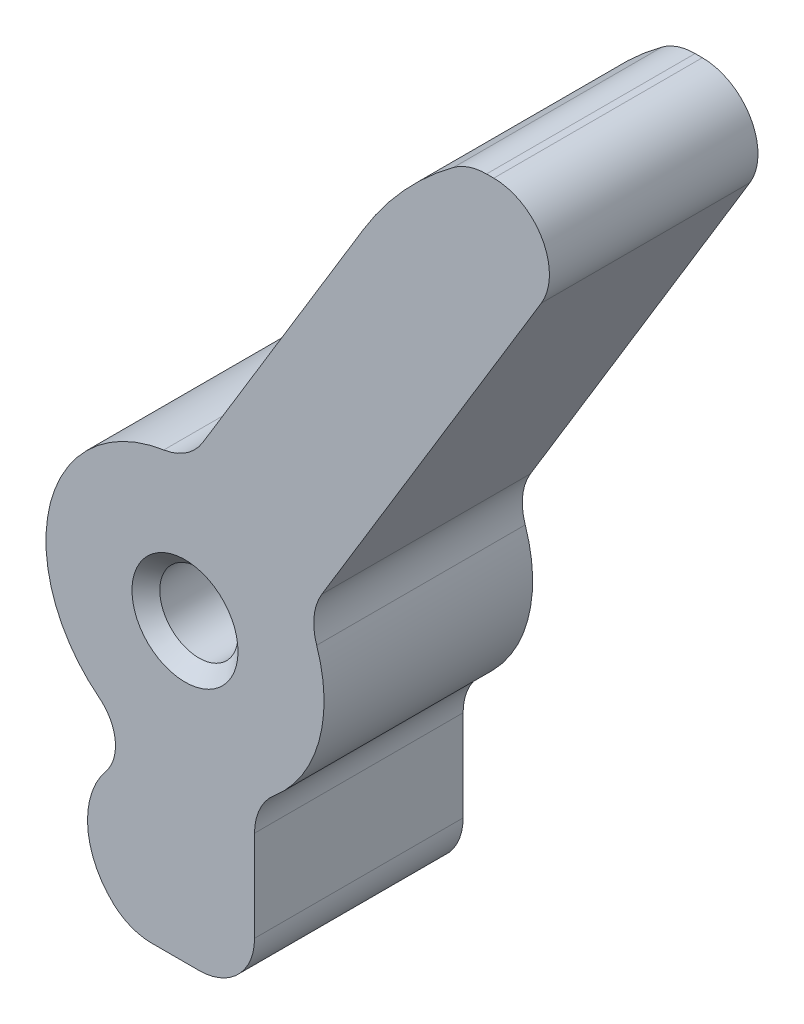
ISO-10303-21;
HEADER;
FILE_DESCRIPTION(('STEP AP214'),'2;1');
FILE_NAME('part.step','',(''),(''),'','','');
FILE_SCHEMA(('AUTOMOTIVE_DESIGN { 1 0 10303 214 1 1 1 1 }'));
ENDSEC;
DATA;
#1=APPLICATION_CONTEXT('core data for automotive mechanical design processes');
#2=APPLICATION_PROTOCOL_DEFINITION('international standard','automotive_design',2000,#1);
#3=PRODUCT_CONTEXT('',#1,'mechanical');
#4=PRODUCT('Part','Part','',(#3));
#5=PRODUCT_RELATED_PRODUCT_CATEGORY('part','',(#4));
#6=PRODUCT_DEFINITION_FORMATION('','',#4);
#7=PRODUCT_DEFINITION_CONTEXT('part definition',#1,'design');
#8=PRODUCT_DEFINITION('design','',#6,#7);
#9=PRODUCT_DEFINITION_SHAPE('','',#8);
#10=(LENGTH_UNIT() NAMED_UNIT(*) SI_UNIT(.MILLI.,.METRE.));
#11=(NAMED_UNIT(*) PLANE_ANGLE_UNIT() SI_UNIT($,.RADIAN.));
#12=(NAMED_UNIT(*) SI_UNIT($,.STERADIAN.) SOLID_ANGLE_UNIT());
#13=UNCERTAINTY_MEASURE_WITH_UNIT(LENGTH_MEASURE(1.E-05),#10,'distance_accuracy_value','');
#14=(GEOMETRIC_REPRESENTATION_CONTEXT(3) GLOBAL_UNCERTAINTY_ASSIGNED_CONTEXT((#13)) GLOBAL_UNIT_ASSIGNED_CONTEXT((#10,
#11,#12)) REPRESENTATION_CONTEXT('',''));
#15=CARTESIAN_POINT('',(0.,0.,0.));
#16=DIRECTION('',(0.,0.,1.));
#17=DIRECTION('',(1.,0.,0.));
#18=AXIS2_PLACEMENT_3D('',#15,#16,#17);
#19=CARTESIAN_POINT('',(10.3283778610675,-19.2479842895087,5.715));
#20=CARTESIAN_POINT('',(10.3283778610675,-19.2479842895087,5.39750000000007));
#21=CARTESIAN_POINT('',(10.3283778610674,-19.2479842895088,5.0799999999999));
#22=CARTESIAN_POINT('',(10.3283778610674,-19.2479842895088,1.58750000000095));
#23=CARTESIAN_POINT('',(10.3283778610674,-19.2479842895088,-1.58750000000067));
#24=CARTESIAN_POINT('',(10.3283778610674,-19.2479842895088,-5.07999999999993));
#25=CARTESIAN_POINT('',(10.3283778610675,-19.2479842895087,-5.39750000000005));
#26=CARTESIAN_POINT('',(10.3283778610675,-19.2479842895087,-5.715));
#27=CARTESIAN_POINT('',(11.0604904353129,-18.35229711104,5.715));
#28=CARTESIAN_POINT('',(11.0604904353129,-18.35229711104,5.39750000000007));
#29=CARTESIAN_POINT('',(11.0604904353128,-18.35229711104,5.0799999999999));
#30=CARTESIAN_POINT('',(11.0604904353128,-18.35229711104,1.58750000000095));
#31=CARTESIAN_POINT('',(11.0604904353128,-18.35229711104,-1.58750000000067));
#32=CARTESIAN_POINT('',(11.0604904353128,-18.35229711104,-5.07999999999993));
#33=CARTESIAN_POINT('',(11.0604904353129,-18.35229711104,-5.39750000000005));
#34=CARTESIAN_POINT('',(11.0604904353129,-18.35229711104,-5.715));
#35=CARTESIAN_POINT('',(10.9332681868804,-17.2024889346275,5.715));
#36=CARTESIAN_POINT('',(10.9332681868804,-17.2024889346275,5.39750000000017));
#37=CARTESIAN_POINT('',(10.9332681868803,-17.2024889346275,5.07999999999976));
#38=CARTESIAN_POINT('',(10.9332681868803,-17.2024889346275,1.58750000000233));
#39=CARTESIAN_POINT('',(10.9332681868803,-17.2024889346275,-1.58750000000067));
#40=CARTESIAN_POINT('',(10.9332681868803,-17.2024889346275,-5.07999999999993));
#41=CARTESIAN_POINT('',(10.9332681868804,-17.2024889346275,-5.39750000000004));
#42=CARTESIAN_POINT('',(10.9332681868804,-17.2024889346275,-5.715));
#43=CARTESIAN_POINT('',(10.0230527558896,-16.4885195989922,5.715));
#44=CARTESIAN_POINT('',(10.0230527558896,-16.4885195989922,5.39750000000017));
#45=CARTESIAN_POINT('',(10.0230527558895,-16.4885195989921,5.07999999999976));
#46=CARTESIAN_POINT('',(10.0230527558895,-16.4885195989921,1.58750000000233));
#47=CARTESIAN_POINT('',(10.0230527558895,-16.4885195989921,-1.58750000000067));
#48=CARTESIAN_POINT('',(10.0230527558895,-16.4885195989921,-5.07999999999993));
#49=CARTESIAN_POINT('',(10.0230527558896,-16.4885195989922,-5.39750000000004));
#50=CARTESIAN_POINT('',(10.0230527558896,-16.4885195989922,-5.715));
#51=(BOUNDED_SURFACE() B_SPLINE_SURFACE(3,3,((#19,#20,#21,#22,#23,#24,#25,#26),(#27,#28,#29,#30,
#31,#32,#33,#34),(#35,#36,#37,#38,#39,#40,#41,#42),(#43,#44,#45,#46,#47,#48,#49,#50)),
.UNSPECIFIED.,.F.,.F.,.F.) B_SPLINE_SURFACE_WITH_KNOTS((4,4),(4,2,2,4),(0.,1.),(-0.1,0.,1.,1.1),
.UNSPECIFIED.) GEOMETRIC_REPRESENTATION_ITEM() RATIONAL_B_SPLINE_SURFACE(((1.,1.,1.,1.,1.,1.,1.,
1.),(0.799978276702998,0.799978276702998,0.799978276703005,0.799978276703005,0.799978276703005,
0.799978276703005,0.799978276702998,0.799978276702998),(0.799978276702998,0.799978276702998,
0.799978276703005,0.799978276703005,0.799978276703005,0.799978276703005,0.799978276702998,
0.799978276702998),(1.,1.,1.,1.,1.,1.,1.,1.))) REPRESENTATION_ITEM('') SURFACE());
#52=CARTESIAN_POINT('',(10.0230527558896,-16.4885195989922,5.715));
#53=CARTESIAN_POINT('',(10.0230527558896,-16.4885195989922,5.39750000000017));
#54=CARTESIAN_POINT('',(10.0230527558895,-16.4885195989921,5.07999999999976));
#55=CARTESIAN_POINT('',(10.0230527558895,-16.4885195989921,1.58750000000233));
#56=CARTESIAN_POINT('',(10.0230527558895,-16.4885195989921,-1.58750000000067));
#57=CARTESIAN_POINT('',(10.0230527558895,-16.4885195989921,-5.07999999999993));
#58=CARTESIAN_POINT('',(10.0230527558896,-16.4885195989922,-5.39750000000004));
#59=CARTESIAN_POINT('',(10.0230527558896,-16.4885195989922,-5.715));
#60=(BOUNDED_CURVE() B_SPLINE_CURVE(3,(#52,#53,#54,#55,#56,#57,#58,#59),.UNSPECIFIED.,.F.,
.F.) B_SPLINE_CURVE_WITH_KNOTS((4,2,2,4),(-0.1,0.,1.,1.1),
.UNSPECIFIED.) CURVE() GEOMETRIC_REPRESENTATION_ITEM() RATIONAL_B_SPLINE_CURVE((1.,1.,1.,1.,1.,
1.,1.,1.)) REPRESENTATION_ITEM(''));
#61=CARTESIAN_POINT('',(10.0230527558895,-16.4885195989921,-4.7625));
#62=VERTEX_POINT('',#61);
#63=CARTESIAN_POINT('',(10.0230527558895,-16.4885195989921,4.7625));
#64=VERTEX_POINT('',#63);
#65=EDGE_CURVE('E265',#62,#64,#60,.F.);
#66=CARTESIAN_POINT('',(10.0230527558895,-16.4885195989921,-4.7625));
#67=CARTESIAN_POINT('',(10.9332681868803,-17.2024889346275,-4.7625));
#68=CARTESIAN_POINT('',(11.0604904353128,-18.35229711104,-4.7625));
#69=CARTESIAN_POINT('',(10.3283778610674,-19.2479842895088,-4.7625));
#70=(BOUNDED_CURVE() B_SPLINE_CURVE(3,(#66,#67,#68,#69),.UNSPECIFIED.,.F.,
.F.) B_SPLINE_CURVE_WITH_KNOTS((4,4),(0.,1.),
.UNSPECIFIED.) CURVE() GEOMETRIC_REPRESENTATION_ITEM() RATIONAL_B_SPLINE_CURVE((1.,
0.799978276703005,0.799978276703005,1.)) REPRESENTATION_ITEM(''));
#71=CARTESIAN_POINT('',(10.3283778610674,-19.2479842895088,-4.7625));
#72=VERTEX_POINT('',#71);
#73=EDGE_CURVE('E50',#62,#72,#70,.T.);
#74=CARTESIAN_POINT('',(10.3283778610675,-19.2479842895087,-5.715));
#75=CARTESIAN_POINT('',(10.3283778610675,-19.2479842895087,-5.39750000000005));
#76=CARTESIAN_POINT('',(10.3283778610674,-19.2479842895088,-5.07999999999993));
#77=CARTESIAN_POINT('',(10.3283778610674,-19.2479842895088,-1.58750000000067));
#78=CARTESIAN_POINT('',(10.3283778610674,-19.2479842895088,1.58750000000095));
#79=CARTESIAN_POINT('',(10.3283778610674,-19.2479842895088,5.0799999999999));
#80=CARTESIAN_POINT('',(10.3283778610675,-19.2479842895087,5.39750000000007));
#81=CARTESIAN_POINT('',(10.3283778610675,-19.2479842895087,5.715));
#82=(BOUNDED_CURVE() B_SPLINE_CURVE(3,(#74,#75,#76,#77,#78,#79,#80,#81),.UNSPECIFIED.,.F.,
.F.) B_SPLINE_CURVE_WITH_KNOTS((4,2,2,4),(-0.1,0.,1.,1.1),
.UNSPECIFIED.) CURVE() GEOMETRIC_REPRESENTATION_ITEM() RATIONAL_B_SPLINE_CURVE((1.,1.,1.,1.,1.,
1.,1.,1.)) REPRESENTATION_ITEM(''));
#83=CARTESIAN_POINT('',(10.3283778610674,-19.2479842895088,4.7625));
#84=VERTEX_POINT('',#83);
#85=EDGE_CURVE('E209',#84,#72,#82,.F.);
#86=CARTESIAN_POINT('',(10.3283778610674,-19.2479842895088,4.7625));
#87=CARTESIAN_POINT('',(11.0604904353128,-18.35229711104,4.7625));
#88=CARTESIAN_POINT('',(10.9332681868803,-17.2024889346275,4.7625));
#89=CARTESIAN_POINT('',(10.0230527558895,-16.4885195989921,4.7625));
#90=(BOUNDED_CURVE() B_SPLINE_CURVE(3,(#86,#87,#88,#89),.UNSPECIFIED.,.F.,
.F.) B_SPLINE_CURVE_WITH_KNOTS((4,4),(0.,1.),
.UNSPECIFIED.) CURVE() GEOMETRIC_REPRESENTATION_ITEM() RATIONAL_B_SPLINE_CURVE((1.,
0.799978276703005,0.799978276703005,1.)) REPRESENTATION_ITEM(''));
#91=EDGE_CURVE('E11',#84,#64,#90,.T.);
#92=ORIENTED_EDGE('',*,*,#65,.F.);
#93=ORIENTED_EDGE('',*,*,#73,.T.);
#94=ORIENTED_EDGE('',*,*,#85,.F.);
#95=ORIENTED_EDGE('',*,*,#91,.T.);
#96=EDGE_LOOP('',(#92,#93,#94,#95));
#97=FACE_BOUND('',#96,.T.);
#98=ADVANCED_FACE('F36',(#97),#51,.T.);
#99=CARTESIAN_POINT('',(35.5869251003677,-0.117322862183878,4.7625));
#100=DIRECTION('',(0.,0.,-1.));
#101=DIRECTION('',(-1.,0.,0.));
#102=AXIS2_PLACEMENT_3D('',#99,#100,#101);
#103=CYLINDRICAL_SURFACE('',#102,15.7811653443104);
#104=CARTESIAN_POINT('',(35.5869251003677,-0.117322862183878,4.7625));
#105=DIRECTION('',(0.,0.,1.));
#106=DIRECTION('',(1.,0.,0.));
#107=AXIS2_PLACEMENT_3D('',#104,#105,#106);
#108=CIRCLE('',#107,15.7811653443104);
#109=CARTESIAN_POINT('',(22.09433781333,8.06774084716687,4.7625));
#110=VERTEX_POINT('',#109);
#111=CARTESIAN_POINT('',(26.2012987581433,12.5694891009772,4.7625));
#112=VERTEX_POINT('',#111);
#113=EDGE_CURVE('E164',#110,#112,#108,.F.);
#114=ORIENTED_EDGE('',*,*,#113,.T.);
#115=DIRECTION('',(0.,0.,-1.));
#116=VECTOR('',#115,1.);
#117=CARTESIAN_POINT('',(26.2012987581433,12.5694891009772,4.7625));
#118=LINE('',#117,#116);
#119=CARTESIAN_POINT('',(26.2012987581433,12.5694891009772,-4.7625));
#120=VERTEX_POINT('',#119);
#121=EDGE_CURVE('E434',#112,#120,#118,.T.);
#122=ORIENTED_EDGE('',*,*,#121,.T.);
#123=CARTESIAN_POINT('',(35.5869251003677,-0.117322862183878,-4.7625));
#124=DIRECTION('',(0.,0.,1.));
#125=DIRECTION('',(1.,0.,0.));
#126=AXIS2_PLACEMENT_3D('',#123,#124,#125);
#127=CIRCLE('',#126,15.7811653443104);
#128=CARTESIAN_POINT('',(22.09433781333,8.06774084716687,-4.7625));
#129=VERTEX_POINT('',#128);
#130=EDGE_CURVE('E167',#129,#120,#127,.F.);
#131=ORIENTED_EDGE('',*,*,#130,.F.);
#132=DIRECTION('',(0.,0.,-1.));
#133=VECTOR('',#132,1.);
#134=CARTESIAN_POINT('',(22.09433781333,8.06774084716687,4.7625));
#135=LINE('',#134,#133);
#136=EDGE_CURVE('E159',#110,#129,#135,.T.);
#137=ORIENTED_EDGE('',*,*,#136,.F.);
#138=EDGE_LOOP('',(#114,#122,#131,#137));
#139=FACE_BOUND('',#138,.T.);
#140=ADVANCED_FACE('F161',(#139),#103,.T.);
#141=CARTESIAN_POINT('',(12.5731789623014,-7.6273192565797,4.7625));
#142=DIRECTION('',(0.854980414478849,-0.518660284634919,0.));
#143=DIRECTION('',(0.518660284634919,0.854980414478849,0.));
#144=AXIS2_PLACEMENT_3D('',#141,#142,#143);
#145=PLANE('',#144);
#146=DIRECTION('',(-0.518660284634919,-0.854980414478849,0.));
#147=VECTOR('',#146,1.);
#148=CARTESIAN_POINT('',(12.5731789623014,-7.6273192565797,-4.7625));
#149=LINE('',#148,#147);
#150=CARTESIAN_POINT('',(14.7594605671866,-4.02336497650998,-4.7625));
#151=VERTEX_POINT('',#150);
#152=EDGE_CURVE('E281',#129,#151,#149,.T.);
#153=ORIENTED_EDGE('',*,*,#152,.T.);
#154=DIRECTION('',(0.,0.,1.));
#155=VECTOR('',#154,1.);
#156=CARTESIAN_POINT('',(14.7594605671866,-4.02336497650998,4.7625));
#157=LINE('',#156,#155);
#158=CARTESIAN_POINT('',(14.7594605671866,-4.02336497650998,4.7625));
#159=VERTEX_POINT('',#158);
#160=EDGE_CURVE('E171',#151,#159,#157,.T.);
#161=ORIENTED_EDGE('',*,*,#160,.T.);
#162=DIRECTION('',(-0.518660284634919,-0.854980414478849,0.));
#163=VECTOR('',#162,1.);
#164=CARTESIAN_POINT('',(12.5731789623014,-7.6273192565797,4.7625));
#165=LINE('',#164,#163);
#166=EDGE_CURVE('E176',#110,#159,#165,.T.);
#167=ORIENTED_EDGE('',*,*,#166,.F.);
#168=ORIENTED_EDGE('',*,*,#136,.T.);
#169=EDGE_LOOP('',(#153,#161,#167,#168));
#170=FACE_BOUND('',#169,.T.);
#171=ADVANCED_FACE('F177',(#170),#145,.F.);
#172=CARTESIAN_POINT('',(13.2019720435092,-21.5967891901671,4.7625));
#173=DIRECTION('',(0.,0.,-1.));
#174=DIRECTION('',(-1.,0.,0.));
#175=AXIS2_PLACEMENT_3D('',#172,#173,#174);
#176=CYLINDRICAL_SURFACE('',#175,3.71139165094716);
#177=CARTESIAN_POINT('',(13.2019720435092,-21.5967891901671,4.7625));
#178=DIRECTION('',(0.,0.,1.));
#179=DIRECTION('',(1.,0.,0.));
#180=AXIS2_PLACEMENT_3D('',#177,#178,#179);
#181=CIRCLE('',#180,3.71139165094716);
#182=CARTESIAN_POINT('',(10.6910364554056,-24.3298516591046,4.7625));
#183=VERTEX_POINT('',#182);
#184=EDGE_CURVE('E179',#84,#183,#181,.T.);
#185=ORIENTED_EDGE('',*,*,#184,.F.);
#186=ORIENTED_EDGE('',*,*,#85,.T.);
#187=CARTESIAN_POINT('',(13.2019720435092,-21.5967891901671,-4.7625));
#188=DIRECTION('',(0.,0.,1.));
#189=DIRECTION('',(1.,0.,0.));
#190=AXIS2_PLACEMENT_3D('',#187,#188,#189);
#191=CIRCLE('',#190,3.71139165094716);
#192=CARTESIAN_POINT('',(10.6910364554056,-24.3298516591046,-4.7625));
#193=VERTEX_POINT('',#192);
#194=EDGE_CURVE('E203',#72,#193,#191,.T.);
#195=ORIENTED_EDGE('',*,*,#194,.T.);
#196=DIRECTION('',(0.,0.,-1.));
#197=VECTOR('',#196,1.);
#198=CARTESIAN_POINT('',(10.6910364554056,-24.3298516591046,4.7625));
#199=LINE('',#198,#197);
#200=EDGE_CURVE('E379',#193,#183,#199,.F.);
#201=ORIENTED_EDGE('',*,*,#200,.T.);
#202=EDGE_LOOP('',(#185,#186,#195,#201));
#203=FACE_BOUND('',#202,.T.);
#204=ADVANCED_FACE('F216',(#203),#176,.T.);
#205=CARTESIAN_POINT('',(0.,-24.9994,4.7625));
#206=DIRECTION('',(0.,-1.,0.));
#207=DIRECTION('',(0.,0.,-1.));
#208=AXIS2_PLACEMENT_3D('',#205,#206,#207);
#209=PLANE('',#208);
#210=DIRECTION('',(-1.,0.,0.));
#211=VECTOR('',#210,1.);
#212=CARTESIAN_POINT('',(0.,-24.9994,4.7625));
#213=LINE('',#212,#211);
#214=CARTESIAN_POINT('',(14.5771458224967,-24.9994,4.7625));
#215=VERTEX_POINT('',#214);
#216=CARTESIAN_POINT('',(12.409469052557,-24.9994,4.7625));
#217=VERTEX_POINT('',#216);
#218=EDGE_CURVE('E198',#215,#217,#213,.T.);
#219=ORIENTED_EDGE('',*,*,#218,.T.);
#220=DIRECTION('',(0.,0.,1.));
#221=VECTOR('',#220,1.);
#222=CARTESIAN_POINT('',(12.409469052557,-24.9994,-4.7625));
#223=LINE('',#222,#221);
#224=CARTESIAN_POINT('',(12.409469052557,-24.9994,-4.7625));
#225=VERTEX_POINT('',#224);
#226=EDGE_CURVE('E392',#217,#225,#223,.F.);
#227=ORIENTED_EDGE('',*,*,#226,.T.);
#228=DIRECTION('',(-1.,0.,0.));
#229=VECTOR('',#228,1.);
#230=CARTESIAN_POINT('',(0.,-24.9994,-4.7625));
#231=LINE('',#230,#229);
#232=CARTESIAN_POINT('',(14.5771458224967,-24.9994,-4.7625));
#233=VERTEX_POINT('',#232);
#234=EDGE_CURVE('E467',#233,#225,#231,.T.);
#235=ORIENTED_EDGE('',*,*,#234,.F.);
#236=DIRECTION('',(0.,0.,-1.));
#237=VECTOR('',#236,1.);
#238=CARTESIAN_POINT('',(14.5771458224967,-24.9994,4.7625));
#239=LINE('',#238,#237);
#240=EDGE_CURVE('E395',#233,#215,#239,.F.);
#241=ORIENTED_EDGE('',*,*,#240,.T.);
#242=EDGE_LOOP('',(#219,#227,#235,#241));
#243=FACE_BOUND('',#242,.T.);
#244=ADVANCED_FACE('F226',(#243),#209,.T.);
#245=CARTESIAN_POINT('',(17.1171458224967,0.,4.7625));
#246=DIRECTION('',(1.,0.,0.));
#247=DIRECTION('',(0.,0.,-1.));
#248=AXIS2_PLACEMENT_3D('',#245,#246,#247);
#249=PLANE('',#248);
#250=DIRECTION('',(0.,-1.,0.));
#251=VECTOR('',#250,1.);
#252=CARTESIAN_POINT('',(17.1171458224967,0.,4.7625));
#253=LINE('',#252,#251);
#254=CARTESIAN_POINT('',(17.1171458224967,-18.301816362175,4.7625));
#255=VERTEX_POINT('',#254);
#256=CARTESIAN_POINT('',(17.1171458224967,-22.4594,4.7625));
#257=VERTEX_POINT('',#256);
#258=EDGE_CURVE('E396',#255,#257,#253,.T.);
#259=ORIENTED_EDGE('',*,*,#258,.T.);
#260=DIRECTION('',(0.,0.,-1.));
#261=VECTOR('',#260,1.);
#262=CARTESIAN_POINT('',(17.1171458224967,-22.4594,4.7625));
#263=LINE('',#262,#261);
#264=CARTESIAN_POINT('',(17.1171458224967,-22.4594,-4.7625));
#265=VERTEX_POINT('',#264);
#266=EDGE_CURVE('E416',#257,#265,#263,.T.);
#267=ORIENTED_EDGE('',*,*,#266,.T.);
#268=DIRECTION('',(0.,-1.,0.));
#269=VECTOR('',#268,1.);
#270=CARTESIAN_POINT('',(17.1171458224967,0.,-4.7625));
#271=LINE('',#270,#269);
#272=CARTESIAN_POINT('',(17.1171458224967,-18.301816362175,-4.7625));
#273=VERTEX_POINT('',#272);
#274=EDGE_CURVE('E469',#273,#265,#271,.T.);
#275=ORIENTED_EDGE('',*,*,#274,.F.);
#276=DIRECTION('',(0.,0.,-1.));
#277=VECTOR('',#276,1.);
#278=CARTESIAN_POINT('',(17.1171458224967,-18.301816362175,4.7625));
#279=LINE('',#278,#277);
#280=EDGE_CURVE('E386',#273,#255,#279,.F.);
#281=ORIENTED_EDGE('',*,*,#280,.T.);
#282=EDGE_LOOP('',(#259,#267,#275,#281));
#283=FACE_BOUND('',#282,.T.);
#284=ADVANCED_FACE('F476',(#283),#249,.T.);
#285=CARTESIAN_POINT('',(18.0023045942421,-10.9208120640114,4.7625));
#286=DIRECTION('',(0.854980414478849,-0.518660284634919,0.));
#287=DIRECTION('',(0.518660284634919,0.854980414478849,0.));
#288=AXIS2_PLACEMENT_3D('',#285,#286,#287);
#289=PLANE('',#288);
#290=DIRECTION('',(-0.518660284634919,-0.854980414478849,0.));
#291=VECTOR('',#290,1.);
#292=CARTESIAN_POINT('',(18.0023045942421,-10.9208120640114,4.7625));
#293=LINE('',#292,#291);
#294=CARTESIAN_POINT('',(30.214422190365,9.21013235820704,4.7625));
#295=VERTEX_POINT('',#294);
#296=CARTESIAN_POINT('',(20.1885861991273,-7.31685778394172,4.7625));
#297=VERTEX_POINT('',#296);
#298=EDGE_CURVE('E457',#295,#297,#293,.T.);
#299=ORIENTED_EDGE('',*,*,#298,.T.);
#300=DIRECTION('',(0.,0.,-1.));
#301=VECTOR('',#300,1.);
#302=CARTESIAN_POINT('',(20.1885861991273,-7.31685778394172,-4.7625));
#303=LINE('',#302,#301);
#304=CARTESIAN_POINT('',(20.1885861991273,-7.31685778394172,-4.7625));
#305=VERTEX_POINT('',#304);
#306=EDGE_CURVE('E427',#297,#305,#303,.T.);
#307=ORIENTED_EDGE('',*,*,#306,.T.);
#308=DIRECTION('',(-0.518660284634919,-0.854980414478849,0.));
#309=VECTOR('',#308,1.);
#310=CARTESIAN_POINT('',(18.0023045942421,-10.9208120640114,-4.7625));
#311=LINE('',#310,#309);
#312=CARTESIAN_POINT('',(30.214422190365,9.21013235820704,-4.7625));
#313=VERTEX_POINT('',#312);
#314=EDGE_CURVE('E189',#313,#305,#311,.T.);
#315=ORIENTED_EDGE('',*,*,#314,.F.);
#316=DIRECTION('',(0.,0.,-1.));
#317=VECTOR('',#316,1.);
#318=CARTESIAN_POINT('',(30.214422190365,9.21013235820704,4.7625));
#319=LINE('',#318,#317);
#320=EDGE_CURVE('E425',#313,#295,#319,.F.);
#321=ORIENTED_EDGE('',*,*,#320,.T.);
#322=EDGE_LOOP('',(#299,#307,#315,#321));
#323=FACE_BOUND('',#322,.T.);
#324=ADVANCED_FACE('F328',(#323),#289,.T.);
#325=CARTESIAN_POINT('',(0.,13.0675294811797,4.7625));
#326=DIRECTION('',(0.,-1.,0.));
#327=DIRECTION('',(0.,0.,-1.));
#328=AXIS2_PLACEMENT_3D('',#325,#326,#327);
#329=PLANE('',#328);
#330=DIRECTION('',(-1.,0.,0.));
#331=VECTOR('',#330,1.);
#332=CARTESIAN_POINT('',(0.,13.0675294811797,4.7625));
#333=LINE('',#332,#331);
#334=CARTESIAN_POINT('',(28.0427719375887,13.0675294811797,4.7625));
#335=VERTEX_POINT('',#334);
#336=CARTESIAN_POINT('',(27.7119280677744,13.0675294811797,4.7625));
#337=VERTEX_POINT('',#336);
#338=EDGE_CURVE('E172',#335,#337,#333,.T.);
#339=ORIENTED_EDGE('',*,*,#338,.F.);
#340=DIRECTION('',(0.,0.,-1.));
#341=VECTOR('',#340,1.);
#342=CARTESIAN_POINT('',(28.0427719375887,13.0675294811797,-4.7625));
#343=LINE('',#342,#341);
#344=CARTESIAN_POINT('',(28.0427719375887,13.0675294811797,-4.7625));
#345=VERTEX_POINT('',#344);
#346=EDGE_CURVE('E431',#335,#345,#343,.T.);
#347=ORIENTED_EDGE('',*,*,#346,.T.);
#348=DIRECTION('',(-1.,0.,0.));
#349=VECTOR('',#348,1.);
#350=CARTESIAN_POINT('',(0.,13.0675294811797,-4.7625));
#351=LINE('',#350,#349);
#352=CARTESIAN_POINT('',(27.7119280677744,13.0675294811797,-4.7625));
#353=VERTEX_POINT('',#352);
#354=EDGE_CURVE('E186',#345,#353,#351,.T.);
#355=ORIENTED_EDGE('',*,*,#354,.T.);
#356=DIRECTION('',(0.,0.,1.));
#357=VECTOR('',#356,1.);
#358=CARTESIAN_POINT('',(27.7119280677744,13.0675294811797,4.7625));
#359=LINE('',#358,#357);
#360=EDGE_CURVE('E429',#353,#337,#359,.T.);
#361=ORIENTED_EDGE('',*,*,#360,.T.);
#362=EDGE_LOOP('',(#339,#347,#355,#361));
#363=FACE_BOUND('',#362,.T.);
#364=ADVANCED_FACE('F321',(#363),#329,.F.);
#365=CARTESIAN_POINT('',(0.,0.,4.7625));
#366=DIRECTION('',(0.,0.,1.));
#367=DIRECTION('',(1.,0.,0.));
#368=AXIS2_PLACEMENT_3D('',#365,#366,#367);
#369=PLANE('',#368);
#370=ORIENTED_EDGE('',*,*,#91,.F.);
#371=ORIENTED_EDGE('',*,*,#184,.T.);
#372=CARTESIAN_POINT('',(12.409469052557,-22.4594,4.7625));
#373=DIRECTION('',(0.,0.,1.));
#374=DIRECTION('',(1.,0.,0.));
#375=AXIS2_PLACEMENT_3D('',#372,#373,#374);
#376=CIRCLE('',#375,2.54);
#377=EDGE_CURVE('E382',#183,#217,#376,.T.);
#378=ORIENTED_EDGE('',*,*,#377,.T.);
#379=ORIENTED_EDGE('',*,*,#218,.F.);
#380=CARTESIAN_POINT('',(14.5771458224967,-22.4594,4.7625));
#381=DIRECTION('',(0.,0.,1.));
#382=DIRECTION('',(1.,0.,0.));
#383=AXIS2_PLACEMENT_3D('',#380,#381,#382);
#384=CIRCLE('',#383,2.54);
#385=EDGE_CURVE('E387',#215,#257,#384,.T.);
#386=ORIENTED_EDGE('',*,*,#385,.T.);
#387=ORIENTED_EDGE('',*,*,#258,.F.);
#388=CARTESIAN_POINT('',(19.6571458224967,-18.301816362175,4.7625));
#389=DIRECTION('',(0.,0.,1.));
#390=DIRECTION('',(1.,0.,0.));
#391=AXIS2_PLACEMENT_3D('',#388,#389,#390);
#392=CIRCLE('',#391,2.54);
#393=CARTESIAN_POINT('',(18.0242886796395,-16.3562116872679,4.7625));
#394=VERTEX_POINT('',#393);
#395=EDGE_CURVE('E442',#255,#394,#392,.F.);
#396=ORIENTED_EDGE('',*,*,#395,.T.);
#397=CARTESIAN_POINT('',(13.9421458224967,-11.4922000000001,4.7625));
#398=DIRECTION('',(0.,0.,1.));
#399=DIRECTION('',(1.,0.,0.));
#400=AXIS2_PLACEMENT_3D('',#397,#398,#399);
#401=CIRCLE('',#400,6.35);
#402=CARTESIAN_POINT('',(19.9550677006444,-9.45081064779604,4.7625));
#403=VERTEX_POINT('',#402);
#404=EDGE_CURVE('E192',#394,#403,#401,.T.);
#405=ORIENTED_EDGE('',*,*,#404,.T.);
#406=CARTESIAN_POINT('',(22.3602364519035,-8.63425490691441,4.7625));
#407=DIRECTION('',(0.,0.,1.));
#408=DIRECTION('',(1.,0.,0.));
#409=AXIS2_PLACEMENT_3D('',#406,#407,#408);
#410=CIRCLE('',#409,2.54);
#411=EDGE_CURVE('E444',#403,#297,#410,.F.);
#412=ORIENTED_EDGE('',*,*,#411,.T.);
#413=ORIENTED_EDGE('',*,*,#298,.F.);
#414=CARTESIAN_POINT('',(28.0427719375887,10.5275294811797,4.7625));
#415=DIRECTION('',(0.,0.,1.));
#416=DIRECTION('',(1.,0.,0.));
#417=AXIS2_PLACEMENT_3D('',#414,#415,#416);
#418=CIRCLE('',#417,2.54);
#419=EDGE_CURVE('E412',#295,#335,#418,.T.);
#420=ORIENTED_EDGE('',*,*,#419,.T.);
#421=ORIENTED_EDGE('',*,*,#338,.T.);
#422=CARTESIAN_POINT('',(27.7119280677744,10.5275294811797,4.7625));
#423=DIRECTION('',(0.,0.,1.));
#424=DIRECTION('',(1.,0.,0.));
#425=AXIS2_PLACEMENT_3D('',#422,#423,#424);
#426=CIRCLE('',#425,2.54);
#427=EDGE_CURVE('E185',#337,#112,#426,.T.);
#428=ORIENTED_EDGE('',*,*,#427,.T.);
#429=ORIENTED_EDGE('',*,*,#113,.F.);
#430=ORIENTED_EDGE('',*,*,#166,.T.);
#431=CARTESIAN_POINT('',(12.5878103144103,-2.70596785353729,4.7625));
#432=DIRECTION('',(0.,0.,1.));
#433=DIRECTION('',(1.,0.,0.));
#434=AXIS2_PLACEMENT_3D('',#431,#432,#433);
#435=CIRCLE('',#434,2.54);
#436=CARTESIAN_POINT('',(12.9747633167207,-5.2163198953838,4.7625));
#437=VERTEX_POINT('',#436);
#438=EDGE_CURVE('E436',#159,#437,#435,.F.);
#439=ORIENTED_EDGE('',*,*,#438,.T.);
#440=EDGE_CURVE('E284',#437,#64,#401,.T.);
#441=ORIENTED_EDGE('',*,*,#440,.T.);
#442=EDGE_LOOP('',(#370,#371,#378,#379,#386,#387,#396,#405,#412,#413,#420,#421,#428,#429,#430,
#439,#441));
#443=FACE_BOUND('',#442,.T.);
#444=CARTESIAN_POINT('',(13.9421458224967,-11.4922000000001,4.7625));
#445=DIRECTION('',(0.,0.,1.));
#446=DIRECTION('',(1.,0.,0.));
#447=AXIS2_PLACEMENT_3D('',#444,#445,#446);
#448=CIRCLE('',#447,2.421001);
#449=CARTESIAN_POINT('',(16.3631468224967,-11.4922000000001,4.7625));
#450=VERTEX_POINT('',#449);
#451=EDGE_CURVE('E295',#450,#450,#448,.T.);
#452=ORIENTED_EDGE('',*,*,#451,.F.);
#453=EDGE_LOOP('',(#452));
#454=FACE_BOUND('',#453,.T.);
#455=ADVANCED_FACE('F181',(#443,#454),#369,.T.);
#456=CARTESIAN_POINT('',(0.,0.,-4.7625));
#457=DIRECTION('',(0.,0.,1.));
#458=DIRECTION('',(1.,0.,0.));
#459=AXIS2_PLACEMENT_3D('',#456,#457,#458);
#460=PLANE('',#459);
#461=CARTESIAN_POINT('',(13.9421458224967,-11.4922000000001,-4.7625));
#462=DIRECTION('',(0.,0.,1.));
#463=DIRECTION('',(1.,0.,0.));
#464=AXIS2_PLACEMENT_3D('',#461,#462,#463);
#465=CIRCLE('',#464,2.421001);
#466=CARTESIAN_POINT('',(16.3631468224967,-11.4922000000001,-4.7625));
#467=VERTEX_POINT('',#466);
#468=EDGE_CURVE('E298',#467,#467,#465,.T.);
#469=ORIENTED_EDGE('',*,*,#468,.T.);
#470=EDGE_LOOP('',(#469));
#471=FACE_BOUND('',#470,.T.);
#472=ORIENTED_EDGE('',*,*,#234,.T.);
#473=CARTESIAN_POINT('',(12.409469052557,-22.4594,-4.7625));
#474=DIRECTION('',(0.,0.,1.));
#475=DIRECTION('',(1.,0.,0.));
#476=AXIS2_PLACEMENT_3D('',#473,#474,#475);
#477=CIRCLE('',#476,2.54);
#478=EDGE_CURVE('E398',#225,#193,#477,.F.);
#479=ORIENTED_EDGE('',*,*,#478,.T.);
#480=ORIENTED_EDGE('',*,*,#194,.F.);
#481=ORIENTED_EDGE('',*,*,#73,.F.);
#482=CARTESIAN_POINT('',(13.9421458224967,-11.4922000000001,-4.7625));
#483=DIRECTION('',(0.,0.,1.));
#484=DIRECTION('',(1.,0.,0.));
#485=AXIS2_PLACEMENT_3D('',#482,#483,#484);
#486=CIRCLE('',#485,6.35);
#487=CARTESIAN_POINT('',(12.9747633167207,-5.2163198953838,-4.7625));
#488=VERTEX_POINT('',#487);
#489=EDGE_CURVE('E273',#488,#62,#486,.T.);
#490=ORIENTED_EDGE('',*,*,#489,.F.);
#491=CARTESIAN_POINT('',(12.5878103144103,-2.70596785353729,-4.7625));
#492=DIRECTION('',(0.,0.,1.));
#493=DIRECTION('',(1.,0.,0.));
#494=AXIS2_PLACEMENT_3D('',#491,#492,#493);
#495=CIRCLE('',#494,2.54);
#496=EDGE_CURVE('E438',#488,#151,#495,.T.);
#497=ORIENTED_EDGE('',*,*,#496,.T.);
#498=ORIENTED_EDGE('',*,*,#152,.F.);
#499=ORIENTED_EDGE('',*,*,#130,.T.);
#500=CARTESIAN_POINT('',(27.7119280677744,10.5275294811797,-4.7625));
#501=DIRECTION('',(0.,0.,1.));
#502=DIRECTION('',(1.,0.,0.));
#503=AXIS2_PLACEMENT_3D('',#500,#501,#502);
#504=CIRCLE('',#503,2.54);
#505=EDGE_CURVE('E399',#120,#353,#504,.F.);
#506=ORIENTED_EDGE('',*,*,#505,.T.);
#507=ORIENTED_EDGE('',*,*,#354,.F.);
#508=CARTESIAN_POINT('',(28.0427719375887,10.5275294811797,-4.7625));
#509=DIRECTION('',(0.,0.,1.));
#510=DIRECTION('',(1.,0.,0.));
#511=AXIS2_PLACEMENT_3D('',#508,#509,#510);
#512=CIRCLE('',#511,2.54);
#513=EDGE_CURVE('E401',#345,#313,#512,.F.);
#514=ORIENTED_EDGE('',*,*,#513,.T.);
#515=ORIENTED_EDGE('',*,*,#314,.T.);
#516=CARTESIAN_POINT('',(22.3602364519035,-8.63425490691441,-4.7625));
#517=DIRECTION('',(0.,0.,1.));
#518=DIRECTION('',(1.,0.,0.));
#519=AXIS2_PLACEMENT_3D('',#516,#517,#518);
#520=CIRCLE('',#519,2.54);
#521=CARTESIAN_POINT('',(19.9550677006444,-9.45081064779604,-4.7625));
#522=VERTEX_POINT('',#521);
#523=EDGE_CURVE('E271',#305,#522,#520,.T.);
#524=ORIENTED_EDGE('',*,*,#523,.T.);
#525=CARTESIAN_POINT('',(18.0242886796395,-16.3562116872679,-4.7625));
#526=VERTEX_POINT('',#525);
#527=EDGE_CURVE('E279',#526,#522,#486,.T.);
#528=ORIENTED_EDGE('',*,*,#527,.F.);
#529=CARTESIAN_POINT('',(19.6571458224967,-18.301816362175,-4.7625));
#530=DIRECTION('',(0.,0.,1.));
#531=DIRECTION('',(1.,0.,0.));
#532=AXIS2_PLACEMENT_3D('',#529,#530,#531);
#533=CIRCLE('',#532,2.54);
#534=EDGE_CURVE('E440',#526,#273,#533,.T.);
#535=ORIENTED_EDGE('',*,*,#534,.T.);
#536=ORIENTED_EDGE('',*,*,#274,.T.);
#537=CARTESIAN_POINT('',(14.5771458224967,-22.4594,-4.7625));
#538=DIRECTION('',(0.,0.,1.));
#539=DIRECTION('',(1.,0.,0.));
#540=AXIS2_PLACEMENT_3D('',#537,#538,#539);
#541=CIRCLE('',#540,2.54);
#542=EDGE_CURVE('E407',#265,#233,#541,.F.);
#543=ORIENTED_EDGE('',*,*,#542,.T.);
#544=EDGE_LOOP('',(#472,#479,#480,#481,#490,#497,#498,#499,#506,#507,#514,#515,#524,#528,#535,
#536,#543));
#545=FACE_BOUND('',#544,.T.);
#546=ADVANCED_FACE('F302',(#471,#545),#460,.F.);
#547=CARTESIAN_POINT('',(13.9421458224967,-11.4922000000001,-4.7625));
#548=DIRECTION('',(0.,0.,1.));
#549=DIRECTION('',(1.,0.,0.));
#550=AXIS2_PLACEMENT_3D('',#547,#548,#549);
#551=CYLINDRICAL_SURFACE('',#550,6.35);
#552=ORIENTED_EDGE('',*,*,#404,.F.);
#553=DIRECTION('',(0.,0.,1.));
#554=VECTOR('',#553,1.);
#555=CARTESIAN_POINT('',(18.0242886796395,-16.3562116872679,-4.7625));
#556=LINE('',#555,#554);
#557=EDGE_CURVE('E422',#394,#526,#556,.F.);
#558=ORIENTED_EDGE('',*,*,#557,.T.);
#559=ORIENTED_EDGE('',*,*,#527,.T.);
#560=DIRECTION('',(0.,0.,1.));
#561=VECTOR('',#560,1.);
#562=CARTESIAN_POINT('',(19.9550677006444,-9.45081064779604,-4.7625));
#563=LINE('',#562,#561);
#564=EDGE_CURVE('E419',#522,#403,#563,.T.);
#565=ORIENTED_EDGE('',*,*,#564,.T.);
#566=EDGE_LOOP('',(#552,#558,#559,#565));
#567=FACE_BOUND('',#566,.T.);
#568=ADVANCED_FACE('F326',(#567),#551,.T.);
#569=ORIENTED_EDGE('',*,*,#489,.T.);
#570=ORIENTED_EDGE('',*,*,#65,.T.);
#571=ORIENTED_EDGE('',*,*,#440,.F.);
#572=DIRECTION('',(0.,0.,1.));
#573=VECTOR('',#572,1.);
#574=CARTESIAN_POINT('',(12.9747633167207,-5.2163198953838,-4.7625));
#575=LINE('',#574,#573);
#576=EDGE_CURVE('E276',#437,#488,#575,.F.);
#577=ORIENTED_EDGE('',*,*,#576,.T.);
#578=EDGE_LOOP('',(#569,#570,#571,#577));
#579=FACE_BOUND('',#578,.T.);
#580=ADVANCED_FACE('F274',(#579),#551,.T.);
#581=CARTESIAN_POINT('',(13.9421458224967,-11.4922000000001,-4.1275));
#582=DIRECTION('',(0.,0.,-1.));
#583=DIRECTION('',(-1.,0.,0.));
#584=AXIS2_PLACEMENT_3D('',#581,#582,#583);
#585=CONICAL_SURFACE('',#584,1.786001,0.785398163397448);
#586=ORIENTED_EDGE('',*,*,#468,.F.);
#587=EDGE_LOOP('',(#586));
#588=FACE_BOUND('',#587,.T.);
#589=CARTESIAN_POINT('',(13.9421458224967,-11.4922000000001,-4.1275));
#590=DIRECTION('',(0.,0.,1.));
#591=DIRECTION('',(1.,0.,0.));
#592=AXIS2_PLACEMENT_3D('',#589,#590,#591);
#593=CIRCLE('',#592,1.786001);
#594=CARTESIAN_POINT('',(15.7281468224967,-11.4922000000001,-4.1275));
#595=VERTEX_POINT('',#594);
#596=EDGE_CURVE('E289',#595,#595,#593,.T.);
#597=ORIENTED_EDGE('',*,*,#596,.T.);
#598=EDGE_LOOP('',(#597));
#599=FACE_BOUND('',#598,.T.);
#600=ADVANCED_FACE('F304',(#588,#599),#585,.F.);
#601=CARTESIAN_POINT('',(13.9421458224967,-11.4922000000001,4.7625));
#602=DIRECTION('',(0.,0.,1.));
#603=DIRECTION('',(1.,0.,0.));
#604=AXIS2_PLACEMENT_3D('',#601,#602,#603);
#605=CYLINDRICAL_SURFACE('',#604,1.78600099999999);
#606=ORIENTED_EDGE('',*,*,#596,.F.);
#607=EDGE_LOOP('',(#606));
#608=FACE_BOUND('',#607,.T.);
#609=CARTESIAN_POINT('',(13.9421458224967,-11.4922000000001,4.12749999999999));
#610=DIRECTION('',(0.,0.,1.));
#611=DIRECTION('',(1.,0.,0.));
#612=AXIS2_PLACEMENT_3D('',#609,#610,#611);
#613=CIRCLE('',#612,1.78600099999999);
#614=CARTESIAN_POINT('',(15.7281468224967,-11.4922000000001,4.12749999999999));
#615=VERTEX_POINT('',#614);
#616=EDGE_CURVE('E292',#615,#615,#613,.T.);
#617=ORIENTED_EDGE('',*,*,#616,.T.);
#618=EDGE_LOOP('',(#617));
#619=FACE_BOUND('',#618,.T.);
#620=ADVANCED_FACE('F307',(#608,#619),#605,.F.);
#621=CARTESIAN_POINT('',(13.9421458224967,-11.4922000000001,4.7625));
#622=DIRECTION('',(0.,0.,1.));
#623=DIRECTION('',(1.,0.,0.));
#624=AXIS2_PLACEMENT_3D('',#621,#622,#623);
#625=CONICAL_SURFACE('',#624,2.421001,0.785398163397447);
#626=ORIENTED_EDGE('',*,*,#616,.F.);
#627=EDGE_LOOP('',(#626));
#628=FACE_BOUND('',#627,.T.);
#629=ORIENTED_EDGE('',*,*,#451,.T.);
#630=EDGE_LOOP('',(#629));
#631=FACE_BOUND('',#630,.T.);
#632=ADVANCED_FACE('F236',(#628,#631),#625,.F.);
#633=CARTESIAN_POINT('',(12.5878103144103,-2.70596785353729,-4.7625));
#634=DIRECTION('',(0.,0.,1.));
#635=DIRECTION('',(1.,0.,0.));
#636=AXIS2_PLACEMENT_3D('',#633,#634,#635);
#637=CYLINDRICAL_SURFACE('',#636,2.54);
#638=ORIENTED_EDGE('',*,*,#496,.F.);
#639=ORIENTED_EDGE('',*,*,#576,.F.);
#640=ORIENTED_EDGE('',*,*,#438,.F.);
#641=ORIENTED_EDGE('',*,*,#160,.F.);
#642=EDGE_LOOP('',(#638,#639,#640,#641));
#643=FACE_BOUND('',#642,.T.);
#644=ADVANCED_FACE('F232',(#643),#637,.F.);
#645=CARTESIAN_POINT('',(12.409469052557,-22.4594,4.7625));
#646=DIRECTION('',(0.,0.,-1.));
#647=DIRECTION('',(-1.,0.,0.));
#648=AXIS2_PLACEMENT_3D('',#645,#646,#647);
#649=CYLINDRICAL_SURFACE('',#648,2.54);
#650=ORIENTED_EDGE('',*,*,#377,.F.);
#651=ORIENTED_EDGE('',*,*,#200,.F.);
#652=ORIENTED_EDGE('',*,*,#478,.F.);
#653=ORIENTED_EDGE('',*,*,#226,.F.);
#654=EDGE_LOOP('',(#650,#651,#652,#653));
#655=FACE_BOUND('',#654,.T.);
#656=ADVANCED_FACE('F235',(#655),#649,.T.);
#657=CARTESIAN_POINT('',(14.5771458224967,-22.4594,4.7625));
#658=DIRECTION('',(0.,0.,-1.));
#659=DIRECTION('',(-1.,0.,0.));
#660=AXIS2_PLACEMENT_3D('',#657,#658,#659);
#661=CYLINDRICAL_SURFACE('',#660,2.54);
#662=ORIENTED_EDGE('',*,*,#385,.F.);
#663=ORIENTED_EDGE('',*,*,#240,.F.);
#664=ORIENTED_EDGE('',*,*,#542,.F.);
#665=ORIENTED_EDGE('',*,*,#266,.F.);
#666=EDGE_LOOP('',(#662,#663,#664,#665));
#667=FACE_BOUND('',#666,.T.);
#668=ADVANCED_FACE('F240',(#667),#661,.T.);
#669=CARTESIAN_POINT('',(19.6571458224967,-18.301816362175,-4.7625));
#670=DIRECTION('',(0.,0.,1.));
#671=DIRECTION('',(1.,0.,0.));
#672=AXIS2_PLACEMENT_3D('',#669,#670,#671);
#673=CYLINDRICAL_SURFACE('',#672,2.54);
#674=ORIENTED_EDGE('',*,*,#395,.F.);
#675=ORIENTED_EDGE('',*,*,#280,.F.);
#676=ORIENTED_EDGE('',*,*,#534,.F.);
#677=ORIENTED_EDGE('',*,*,#557,.F.);
#678=EDGE_LOOP('',(#674,#675,#676,#677));
#679=FACE_BOUND('',#678,.T.);
#680=ADVANCED_FACE('F244',(#679),#673,.F.);
#681=CARTESIAN_POINT('',(22.3602364519035,-8.63425490691441,-4.7625));
#682=DIRECTION('',(0.,0.,1.));
#683=DIRECTION('',(1.,0.,0.));
#684=AXIS2_PLACEMENT_3D('',#681,#682,#683);
#685=CYLINDRICAL_SURFACE('',#684,2.54);
#686=ORIENTED_EDGE('',*,*,#523,.F.);
#687=ORIENTED_EDGE('',*,*,#306,.F.);
#688=ORIENTED_EDGE('',*,*,#411,.F.);
#689=ORIENTED_EDGE('',*,*,#564,.F.);
#690=EDGE_LOOP('',(#686,#687,#688,#689));
#691=FACE_BOUND('',#690,.T.);
#692=ADVANCED_FACE('F248',(#691),#685,.F.);
#693=CARTESIAN_POINT('',(28.0427719375887,10.5275294811797,4.7625));
#694=DIRECTION('',(0.,0.,1.));
#695=DIRECTION('',(1.,0.,0.));
#696=AXIS2_PLACEMENT_3D('',#693,#694,#695);
#697=CYLINDRICAL_SURFACE('',#696,2.54);
#698=ORIENTED_EDGE('',*,*,#419,.F.);
#699=ORIENTED_EDGE('',*,*,#320,.F.);
#700=ORIENTED_EDGE('',*,*,#513,.F.);
#701=ORIENTED_EDGE('',*,*,#346,.F.);
#702=EDGE_LOOP('',(#698,#699,#700,#701));
#703=FACE_BOUND('',#702,.T.);
#704=ADVANCED_FACE('F252',(#703),#697,.T.);
#705=CARTESIAN_POINT('',(27.7119280677744,10.5275294811797,4.7625));
#706=DIRECTION('',(0.,0.,-1.));
#707=DIRECTION('',(-1.,0.,0.));
#708=AXIS2_PLACEMENT_3D('',#705,#706,#707);
#709=CYLINDRICAL_SURFACE('',#708,2.54);
#710=ORIENTED_EDGE('',*,*,#427,.F.);
#711=ORIENTED_EDGE('',*,*,#360,.F.);
#712=ORIENTED_EDGE('',*,*,#505,.F.);
#713=ORIENTED_EDGE('',*,*,#121,.F.);
#714=EDGE_LOOP('',(#710,#711,#712,#713));
#715=FACE_BOUND('',#714,.T.);
#716=ADVANCED_FACE('F255',(#715),#709,.T.);
#717=CLOSED_SHELL('',(#98,#140,#171,#204,#244,#284,#324,#364,#455,#546,#568,#580,#600,#620,#632,
#644,#656,#668,#680,#692,#704,#716));
#718=MANIFOLD_SOLID_BREP('B2',#717);
#719=ADVANCED_BREP_SHAPE_REPRESENTATION('',(#18,#718),#14);
#720=SHAPE_DEFINITION_REPRESENTATION(#9,#719);
ENDSEC;
END-ISO-10303-21;
